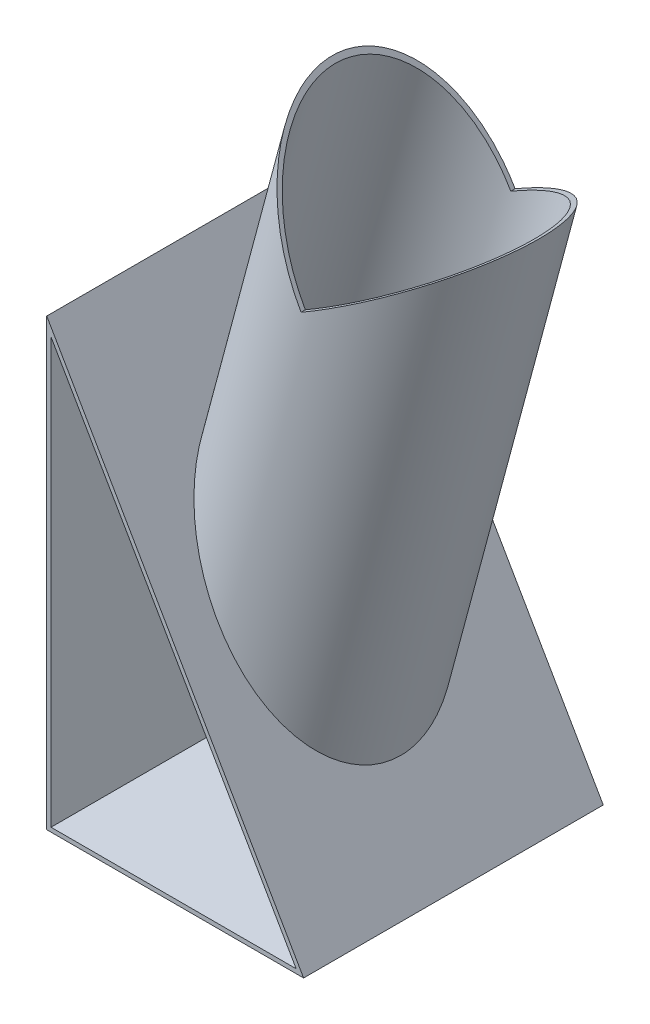
ISO-10303-21;
HEADER;
FILE_DESCRIPTION(('STEP AP214'),'2;1');
FILE_NAME('part.step','',(''),(''),'','','');
FILE_SCHEMA(('AUTOMOTIVE_DESIGN { 1 0 10303 214 1 1 1 1 }'));
ENDSEC;
DATA;
#1=APPLICATION_CONTEXT('core data for automotive mechanical design processes');
#2=APPLICATION_PROTOCOL_DEFINITION('international standard','automotive_design',2000,#1);
#3=PRODUCT_CONTEXT('',#1,'mechanical');
#4=PRODUCT('Part','Part','',(#3));
#5=PRODUCT_RELATED_PRODUCT_CATEGORY('part','',(#4));
#6=PRODUCT_DEFINITION_FORMATION('','',#4);
#7=PRODUCT_DEFINITION_CONTEXT('part definition',#1,'design');
#8=PRODUCT_DEFINITION('design','',#6,#7);
#9=PRODUCT_DEFINITION_SHAPE('','',#8);
#10=(LENGTH_UNIT() NAMED_UNIT(*) SI_UNIT(.MILLI.,.METRE.));
#11=(NAMED_UNIT(*) PLANE_ANGLE_UNIT() SI_UNIT($,.RADIAN.));
#12=(NAMED_UNIT(*) SI_UNIT($,.STERADIAN.) SOLID_ANGLE_UNIT());
#13=UNCERTAINTY_MEASURE_WITH_UNIT(LENGTH_MEASURE(1.E-05),#10,'distance_accuracy_value','');
#14=(GEOMETRIC_REPRESENTATION_CONTEXT(3) GLOBAL_UNCERTAINTY_ASSIGNED_CONTEXT((#13)) GLOBAL_UNIT_ASSIGNED_CONTEXT((#10,
#11,#12)) REPRESENTATION_CONTEXT('',''));
#15=CARTESIAN_POINT('',(0.,0.,0.));
#16=DIRECTION('',(0.,0.,1.));
#17=DIRECTION('',(1.,0.,0.));
#18=AXIS2_PLACEMENT_3D('',#15,#16,#17);
#19=CARTESIAN_POINT('',(31.7271718624391,155.,10.));
#20=DIRECTION('',(-0.866025403784437,-0.500000000000003,0.));
#21=DIRECTION('',(0.500000000000003,-0.866025403784437,0.));
#22=AXIS2_PLACEMENT_3D('',#19,#20,#21);
#23=PLANE('',#22);
#24=CARTESIAN_POINT('',(49.4048413921029,124.38137821521,35.));
#25=DIRECTION('',(-0.866025403784437,-0.500000000000003,0.));
#26=DIRECTION('',(0.500000000000003,-0.866025403784437,0.));
#27=AXIS2_PLACEMENT_3D('',#24,#25,#26);
#28=ELLIPSE('',#27,33.9411254969543,24.);
#29=CARTESIAN_POINT('',(49.4048413921029,124.38137821521,11.));
#30=VERTEX_POINT('',#29);
#31=CARTESIAN_POINT('',(49.4048413921029,124.38137821521,59.));
#32=VERTEX_POINT('',#31);
#33=EDGE_CURVE('E123',#30,#32,#28,.F.);
#34=ORIENTED_EDGE('',*,*,#33,.F.);
#35=DIRECTION('',(0.,0.,1.));
#36=VECTOR('',#35,1.);
#37=CARTESIAN_POINT('',(49.4048413921029,124.38137821521,10.));
#38=LINE('',#37,#36);
#39=CARTESIAN_POINT('',(49.4048413921029,124.38137821521,10.));
#40=VERTEX_POINT('',#39);
#41=EDGE_CURVE('E126',#40,#30,#38,.T.);
#42=ORIENTED_EDGE('',*,*,#41,.F.);
#43=CARTESIAN_POINT('',(49.4048413921029,124.38137821521,35.));
#44=DIRECTION('',(-0.866025403784437,-0.500000000000003,0.));
#45=DIRECTION('',(0.500000000000003,-0.866025403784437,0.));
#46=AXIS2_PLACEMENT_3D('',#43,#44,#45);
#47=ELLIPSE('',#46,35.3553390593274,25.);
#48=CARTESIAN_POINT('',(49.4048413921029,124.38137821521,60.));
#49=VERTEX_POINT('',#48);
#50=EDGE_CURVE('E11',#40,#49,#47,.F.);
#51=ORIENTED_EDGE('',*,*,#50,.T.);
#52=EDGE_CURVE('E125',#32,#49,#38,.T.);
#53=ORIENTED_EDGE('',*,*,#52,.F.);
#54=EDGE_LOOP('',(#34,#42,#51,#53));
#55=FACE_BOUND('',#54,.T.);
#56=ADVANCED_FACE('F30',(#55),#23,.F.);
#57=CARTESIAN_POINT('',(49.4048413921029,124.38137821521,10.));
#58=DIRECTION('',(0.500000000000003,-0.866025403784437,0.));
#59=DIRECTION('',(0.866025403784437,0.500000000000003,0.));
#60=AXIS2_PLACEMENT_3D('',#57,#58,#59);
#61=PLANE('',#60);
#62=CARTESIAN_POINT('',(49.4048413921029,124.38137821521,35.));
#63=DIRECTION('',(0.500000000000003,-0.866025403784437,0.));
#64=DIRECTION('',(-0.866025403784437,-0.500000000000003,0.));
#65=AXIS2_PLACEMENT_3D('',#62,#63,#64);
#66=ELLIPSE('',#65,33.9411254969543,24.);
#67=EDGE_CURVE('E121',#32,#30,#66,.F.);
#68=ORIENTED_EDGE('',*,*,#67,.F.);
#69=ORIENTED_EDGE('',*,*,#52,.T.);
#70=CARTESIAN_POINT('',(49.4048413921029,124.38137821521,35.));
#71=DIRECTION('',(0.500000000000003,-0.866025403784437,0.));
#72=DIRECTION('',(-0.866025403784437,-0.500000000000003,0.));
#73=AXIS2_PLACEMENT_3D('',#70,#71,#72);
#74=ELLIPSE('',#73,35.3553390593274,25.);
#75=EDGE_CURVE('E38',#49,#40,#74,.F.);
#76=ORIENTED_EDGE('',*,*,#75,.T.);
#77=ORIENTED_EDGE('',*,*,#41,.T.);
#78=EDGE_LOOP('',(#68,#69,#76,#77));
#79=FACE_BOUND('',#78,.T.);
#80=ADVANCED_FACE('F158',(#79),#61,.F.);
#81=CARTESIAN_POINT('',(0.,103.923048454131,70.));
#82=DIRECTION('',(1.,0.,0.));
#83=DIRECTION('',(0.,0.,-1.));
#84=AXIS2_PLACEMENT_3D('',#81,#82,#83);
#85=PLANE('',#84);
#86=DIRECTION('',(0.,-1.,0.));
#87=VECTOR('',#86,1.);
#88=CARTESIAN_POINT('',(0.,103.923048454131,0.));
#89=LINE('',#88,#87);
#90=CARTESIAN_POINT('',(0.,103.923048454131,0.));
#91=VERTEX_POINT('',#90);
#92=CARTESIAN_POINT('',(0.,0.,0.));
#93=VERTEX_POINT('',#92);
#94=EDGE_CURVE('E130',#91,#93,#89,.T.);
#95=ORIENTED_EDGE('',*,*,#94,.T.);
#96=DIRECTION('',(0.,0.,-1.));
#97=VECTOR('',#96,1.);
#98=CARTESIAN_POINT('',(0.,0.,70.));
#99=LINE('',#98,#97);
#100=CARTESIAN_POINT('',(0.,0.,70.));
#101=VERTEX_POINT('',#100);
#102=EDGE_CURVE('E150',#101,#93,#99,.T.);
#103=ORIENTED_EDGE('',*,*,#102,.F.);
#104=DIRECTION('',(0.,-1.,0.));
#105=VECTOR('',#104,1.);
#106=CARTESIAN_POINT('',(0.,103.923048454131,70.));
#107=LINE('',#106,#105);
#108=CARTESIAN_POINT('',(0.,103.923048454131,70.));
#109=VERTEX_POINT('',#108);
#110=EDGE_CURVE('E137',#109,#101,#107,.T.);
#111=ORIENTED_EDGE('',*,*,#110,.F.);
#112=DIRECTION('',(0.,0.,-1.));
#113=VECTOR('',#112,1.);
#114=CARTESIAN_POINT('',(0.,103.923048454131,70.));
#115=LINE('',#114,#113);
#116=EDGE_CURVE('E144',#109,#91,#115,.T.);
#117=ORIENTED_EDGE('',*,*,#116,.T.);
#118=EDGE_LOOP('',(#95,#103,#111,#117));
#119=FACE_BOUND('',#118,.T.);
#120=ADVANCED_FACE('F32',(#119),#85,.F.);
#121=CARTESIAN_POINT('',(0.,0.,70.));
#122=DIRECTION('',(0.,1.,0.));
#123=DIRECTION('',(0.,0.,1.));
#124=AXIS2_PLACEMENT_3D('',#121,#122,#123);
#125=PLANE('',#124);
#126=DIRECTION('',(1.,0.,0.));
#127=VECTOR('',#126,1.);
#128=CARTESIAN_POINT('',(0.,0.,0.));
#129=LINE('',#128,#127);
#130=CARTESIAN_POINT('',(60.,0.,0.));
#131=VERTEX_POINT('',#130);
#132=EDGE_CURVE('E133',#93,#131,#129,.T.);
#133=ORIENTED_EDGE('',*,*,#132,.T.);
#134=DIRECTION('',(0.,0.,-1.));
#135=VECTOR('',#134,1.);
#136=CARTESIAN_POINT('',(60.,0.,70.));
#137=LINE('',#136,#135);
#138=CARTESIAN_POINT('',(60.,0.,70.));
#139=VERTEX_POINT('',#138);
#140=EDGE_CURVE('E147',#139,#131,#137,.T.);
#141=ORIENTED_EDGE('',*,*,#140,.F.);
#142=DIRECTION('',(1.,0.,0.));
#143=VECTOR('',#142,1.);
#144=CARTESIAN_POINT('',(0.,0.,70.));
#145=LINE('',#144,#143);
#146=EDGE_CURVE('E140',#101,#139,#145,.T.);
#147=ORIENTED_EDGE('',*,*,#146,.F.);
#148=ORIENTED_EDGE('',*,*,#102,.T.);
#149=EDGE_LOOP('',(#133,#141,#147,#148));
#150=FACE_BOUND('',#149,.T.);
#151=ADVANCED_FACE('F174',(#150),#125,.F.);
#152=CARTESIAN_POINT('',(60.,0.,70.));
#153=DIRECTION('',(-0.866025403784436,-0.500000000000004,0.));
#154=DIRECTION('',(0.500000000000004,-0.866025403784436,0.));
#155=AXIS2_PLACEMENT_3D('',#152,#153,#154);
#156=PLANE('',#155);
#157=CARTESIAN_POINT('',(30.,51.9615242270657,35.));
#158=DIRECTION('',(-0.866025403784436,-0.500000000000004,0.));
#159=DIRECTION('',(0.500000000000004,-0.866025403784436,0.));
#160=AXIS2_PLACEMENT_3D('',#157,#158,#159);
#161=ELLIPSE('',#160,35.3553390593273,25.);
#162=CARTESIAN_POINT('',(47.6776695296638,21.3429024422761,35.));
#163=VERTEX_POINT('',#162);
#164=EDGE_CURVE('E129',#163,#163,#161,.T.);
#165=ORIENTED_EDGE('',*,*,#164,.T.);
#166=EDGE_LOOP('',(#165));
#167=FACE_BOUND('',#166,.T.);
#168=DIRECTION('',(-0.500000000000004,0.866025403784436,0.));
#169=VECTOR('',#168,1.);
#170=CARTESIAN_POINT('',(60.,0.,0.));
#171=LINE('',#170,#169);
#172=EDGE_CURVE('E135',#131,#91,#171,.T.);
#173=ORIENTED_EDGE('',*,*,#172,.T.);
#174=ORIENTED_EDGE('',*,*,#116,.F.);
#175=DIRECTION('',(-0.500000000000004,0.866025403784436,0.));
#176=VECTOR('',#175,1.);
#177=CARTESIAN_POINT('',(60.,0.,70.));
#178=LINE('',#177,#176);
#179=EDGE_CURVE('E142',#139,#109,#178,.T.);
#180=ORIENTED_EDGE('',*,*,#179,.F.);
#181=ORIENTED_EDGE('',*,*,#140,.T.);
#182=EDGE_LOOP('',(#173,#174,#180,#181));
#183=FACE_BOUND('',#182,.T.);
#184=ADVANCED_FACE('F170',(#167,#183),#156,.F.);
#185=CARTESIAN_POINT('',(0.,0.,70.));
#186=DIRECTION('',(0.,0.,1.));
#187=DIRECTION('',(1.,0.,0.));
#188=AXIS2_PLACEMENT_3D('',#185,#186,#187);
#189=PLANE('',#188);
#190=DIRECTION('',(0.,-1.,0.));
#191=VECTOR('',#190,1.);
#192=CARTESIAN_POINT('',(1.,103.923048454131,70.));
#193=LINE('',#192,#191);
#194=CARTESIAN_POINT('',(1.,100.190997646563,70.));
#195=VERTEX_POINT('',#194);
#196=CARTESIAN_POINT('',(1.,1.,70.));
#197=VERTEX_POINT('',#196);
#198=EDGE_CURVE('E112',#195,#197,#193,.T.);
#199=ORIENTED_EDGE('',*,*,#198,.F.);
#200=DIRECTION('',(-0.500000000000004,0.866025403784436,0.));
#201=VECTOR('',#200,1.);
#202=CARTESIAN_POINT('',(59.1339745962156,-0.500000000000004,70.));
#203=LINE('',#202,#201);
#204=CARTESIAN_POINT('',(58.2679491924311,1.,70.));
#205=VERTEX_POINT('',#204);
#206=EDGE_CURVE('E95',#205,#195,#203,.T.);
#207=ORIENTED_EDGE('',*,*,#206,.F.);
#208=DIRECTION('',(1.,0.,0.));
#209=VECTOR('',#208,1.);
#210=CARTESIAN_POINT('',(0.,1.,70.));
#211=LINE('',#210,#209);
#212=EDGE_CURVE('E114',#197,#205,#211,.T.);
#213=ORIENTED_EDGE('',*,*,#212,.F.);
#214=EDGE_LOOP('',(#199,#207,#213));
#215=FACE_BOUND('',#214,.T.);
#216=ORIENTED_EDGE('',*,*,#110,.T.);
#217=ORIENTED_EDGE('',*,*,#146,.T.);
#218=ORIENTED_EDGE('',*,*,#179,.T.);
#219=EDGE_LOOP('',(#216,#217,#218));
#220=FACE_BOUND('',#219,.T.);
#221=ADVANCED_FACE('F173',(#215,#220),#189,.T.);
#222=CARTESIAN_POINT('',(0.,0.,0.));
#223=DIRECTION('',(0.,0.,1.));
#224=DIRECTION('',(1.,0.,0.));
#225=AXIS2_PLACEMENT_3D('',#222,#223,#224);
#226=PLANE('',#225);
#227=DIRECTION('',(-0.500000000000004,0.866025403784436,0.));
#228=VECTOR('',#227,1.);
#229=CARTESIAN_POINT('',(59.1339745962156,-0.500000000000004,0.));
#230=LINE('',#229,#228);
#231=CARTESIAN_POINT('',(58.2679491924311,1.,0.));
#232=VERTEX_POINT('',#231);
#233=CARTESIAN_POINT('',(1.,100.190997646563,0.));
#234=VERTEX_POINT('',#233);
#235=EDGE_CURVE('E50',#232,#234,#230,.T.);
#236=ORIENTED_EDGE('',*,*,#235,.T.);
#237=DIRECTION('',(0.,-1.,0.));
#238=VECTOR('',#237,1.);
#239=CARTESIAN_POINT('',(1.,103.923048454131,0.));
#240=LINE('',#239,#238);
#241=CARTESIAN_POINT('',(1.,1.,0.));
#242=VERTEX_POINT('',#241);
#243=EDGE_CURVE('E101',#234,#242,#240,.T.);
#244=ORIENTED_EDGE('',*,*,#243,.T.);
#245=DIRECTION('',(1.,0.,0.));
#246=VECTOR('',#245,1.);
#247=CARTESIAN_POINT('',(0.,1.,0.));
#248=LINE('',#247,#246);
#249=EDGE_CURVE('E107',#242,#232,#248,.T.);
#250=ORIENTED_EDGE('',*,*,#249,.T.);
#251=EDGE_LOOP('',(#236,#244,#250));
#252=FACE_BOUND('',#251,.T.);
#253=ORIENTED_EDGE('',*,*,#94,.F.);
#254=ORIENTED_EDGE('',*,*,#172,.F.);
#255=ORIENTED_EDGE('',*,*,#132,.F.);
#256=EDGE_LOOP('',(#253,#254,#255));
#257=FACE_BOUND('',#256,.T.);
#258=ADVANCED_FACE('F110',(#252,#257),#226,.F.);
#259=CARTESIAN_POINT('',(30.,51.9615242270657,35.));
#260=DIRECTION('',(-0.258819045102518,-0.965925826289069,0.));
#261=DIRECTION('',(0.965925826289069,-0.258819045102518,0.));
#262=AXIS2_PLACEMENT_3D('',#259,#260,#261);
#263=CYLINDRICAL_SURFACE('',#262,25.);
#264=ORIENTED_EDGE('',*,*,#75,.F.);
#265=ORIENTED_EDGE('',*,*,#50,.F.);
#266=EDGE_LOOP('',(#264,#265));
#267=FACE_BOUND('',#266,.T.);
#268=ORIENTED_EDGE('',*,*,#164,.F.);
#269=EDGE_LOOP('',(#268));
#270=FACE_BOUND('',#269,.T.);
#271=ADVANCED_FACE('F164',(#267,#270),#263,.T.);
#272=CARTESIAN_POINT('',(1.,103.923048454131,70.));
#273=DIRECTION('',(1.,0.,0.));
#274=DIRECTION('',(0.,0.,-1.));
#275=AXIS2_PLACEMENT_3D('',#272,#273,#274);
#276=PLANE('',#275);
#277=ORIENTED_EDGE('',*,*,#243,.F.);
#278=DIRECTION('',(0.,0.,-1.));
#279=VECTOR('',#278,1.);
#280=CARTESIAN_POINT('',(1.,100.190997646563,70.));
#281=LINE('',#280,#279);
#282=EDGE_CURVE('E91',#195,#234,#281,.T.);
#283=ORIENTED_EDGE('',*,*,#282,.F.);
#284=ORIENTED_EDGE('',*,*,#198,.T.);
#285=DIRECTION('',(0.,0.,-1.));
#286=VECTOR('',#285,1.);
#287=CARTESIAN_POINT('',(1.,1.,70.));
#288=LINE('',#287,#286);
#289=EDGE_CURVE('E104',#197,#242,#288,.T.);
#290=ORIENTED_EDGE('',*,*,#289,.T.);
#291=EDGE_LOOP('',(#277,#283,#284,#290));
#292=FACE_BOUND('',#291,.T.);
#293=ADVANCED_FACE('F102',(#292),#276,.T.);
#294=CARTESIAN_POINT('',(0.,1.,70.));
#295=DIRECTION('',(0.,1.,0.));
#296=DIRECTION('',(0.,0.,1.));
#297=AXIS2_PLACEMENT_3D('',#294,#295,#296);
#298=PLANE('',#297);
#299=ORIENTED_EDGE('',*,*,#249,.F.);
#300=ORIENTED_EDGE('',*,*,#289,.F.);
#301=ORIENTED_EDGE('',*,*,#212,.T.);
#302=DIRECTION('',(0.,0.,-1.));
#303=VECTOR('',#302,1.);
#304=CARTESIAN_POINT('',(58.2679491924311,1.,70.));
#305=LINE('',#304,#303);
#306=EDGE_CURVE('E45',#205,#232,#305,.T.);
#307=ORIENTED_EDGE('',*,*,#306,.T.);
#308=EDGE_LOOP('',(#299,#300,#301,#307));
#309=FACE_BOUND('',#308,.T.);
#310=ADVANCED_FACE('F206',(#309),#298,.T.);
#311=CARTESIAN_POINT('',(59.1339745962156,-0.500000000000004,70.));
#312=DIRECTION('',(-0.866025403784436,-0.500000000000004,0.));
#313=DIRECTION('',(0.500000000000004,-0.866025403784436,0.));
#314=AXIS2_PLACEMENT_3D('',#311,#312,#313);
#315=PLANE('',#314);
#316=CARTESIAN_POINT('',(29.6339745962156,50.5954988232813,35.));
#317=DIRECTION('',(-0.866025403784436,-0.500000000000004,0.));
#318=DIRECTION('',(0.500000000000004,-0.866025403784436,0.));
#319=AXIS2_PLACEMENT_3D('',#316,#317,#318);
#320=ELLIPSE('',#319,33.9411254969542,24.);
#321=CARTESIAN_POINT('',(46.6045373446928,21.2016219098833,35.));
#322=VERTEX_POINT('',#321);
#323=EDGE_CURVE('E108',#322,#322,#320,.T.);
#324=ORIENTED_EDGE('',*,*,#323,.F.);
#325=EDGE_LOOP('',(#324));
#326=FACE_BOUND('',#325,.T.);
#327=ORIENTED_EDGE('',*,*,#235,.F.);
#328=ORIENTED_EDGE('',*,*,#306,.F.);
#329=ORIENTED_EDGE('',*,*,#206,.T.);
#330=ORIENTED_EDGE('',*,*,#282,.T.);
#331=EDGE_LOOP('',(#327,#328,#329,#330));
#332=FACE_BOUND('',#331,.T.);
#333=ADVANCED_FACE('F93',(#326,#332),#315,.T.);
#334=CARTESIAN_POINT('',(30.,51.9615242270657,35.));
#335=DIRECTION('',(-0.258819045102518,-0.965925826289069,0.));
#336=DIRECTION('',(0.965925826289069,-0.258819045102518,0.));
#337=AXIS2_PLACEMENT_3D('',#334,#335,#336);
#338=CYLINDRICAL_SURFACE('',#337,24.);
#339=ORIENTED_EDGE('',*,*,#67,.T.);
#340=ORIENTED_EDGE('',*,*,#33,.T.);
#341=EDGE_LOOP('',(#339,#340));
#342=FACE_BOUND('',#341,.T.);
#343=ORIENTED_EDGE('',*,*,#323,.T.);
#344=EDGE_LOOP('',(#343));
#345=FACE_BOUND('',#344,.T.);
#346=ADVANCED_FACE('F200',(#342,#345),#338,.F.);
#347=CLOSED_SHELL('',(#56,#80,#120,#151,#184,#221,#258,#271,#293,#310,#333,#346));
#348=MANIFOLD_SOLID_BREP('B2',#347);
#349=ADVANCED_BREP_SHAPE_REPRESENTATION('',(#18,#348),#14);
#350=SHAPE_DEFINITION_REPRESENTATION(#9,#349);
ENDSEC;
END-ISO-10303-21;
